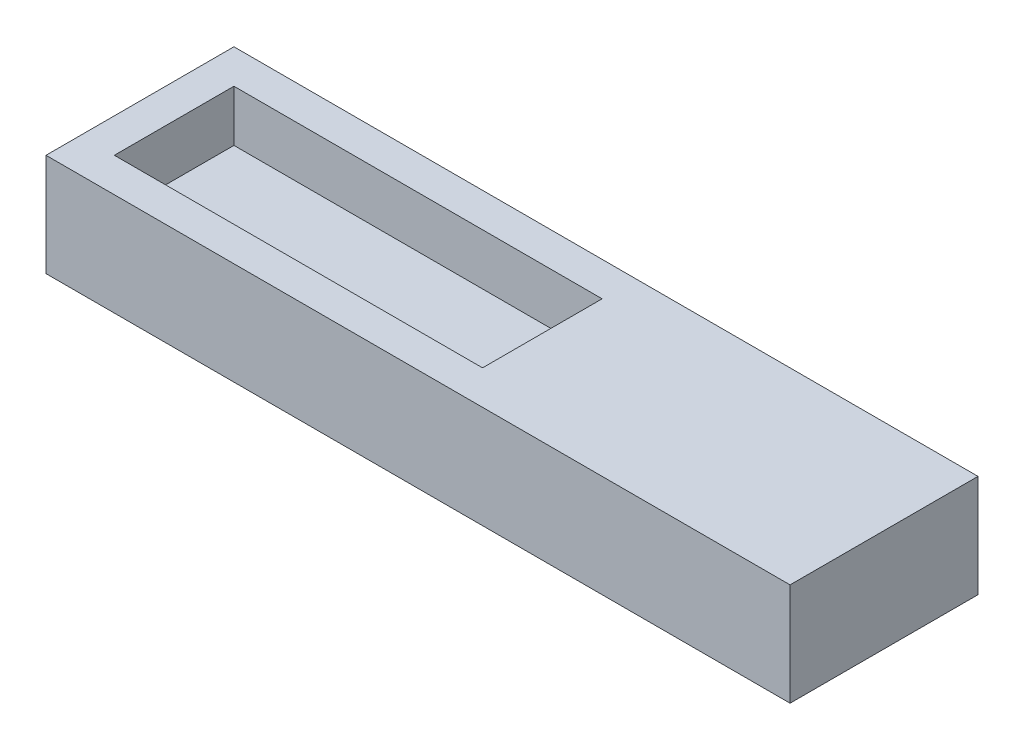
ISO-10303-21;
HEADER;
FILE_DESCRIPTION(('STEP AP214'),'2;1');
FILE_NAME('part.step','',(''),(''),'','','');
FILE_SCHEMA(('AUTOMOTIVE_DESIGN { 1 0 10303 214 1 1 1 1 }'));
ENDSEC;
DATA;
#1=APPLICATION_CONTEXT('core data for automotive mechanical design processes');
#2=APPLICATION_PROTOCOL_DEFINITION('international standard','automotive_design',2000,#1);
#3=PRODUCT_CONTEXT('',#1,'mechanical');
#4=PRODUCT('Part','Part','',(#3));
#5=PRODUCT_RELATED_PRODUCT_CATEGORY('part','',(#4));
#6=PRODUCT_DEFINITION_FORMATION('','',#4);
#7=PRODUCT_DEFINITION_CONTEXT('part definition',#1,'design');
#8=PRODUCT_DEFINITION('design','',#6,#7);
#9=PRODUCT_DEFINITION_SHAPE('','',#8);
#10=(LENGTH_UNIT() NAMED_UNIT(*) SI_UNIT(.MILLI.,.METRE.));
#11=(NAMED_UNIT(*) PLANE_ANGLE_UNIT() SI_UNIT($,.RADIAN.));
#12=(NAMED_UNIT(*) SI_UNIT($,.STERADIAN.) SOLID_ANGLE_UNIT());
#13=UNCERTAINTY_MEASURE_WITH_UNIT(LENGTH_MEASURE(1.E-05),#10,'distance_accuracy_value','');
#14=(GEOMETRIC_REPRESENTATION_CONTEXT(3) GLOBAL_UNCERTAINTY_ASSIGNED_CONTEXT((#13)) GLOBAL_UNIT_ASSIGNED_CONTEXT((#10,
#11,#12)) REPRESENTATION_CONTEXT('',''));
#15=CARTESIAN_POINT('',(0.,0.,0.));
#16=DIRECTION('',(0.,0.,1.));
#17=DIRECTION('',(1.,0.,0.));
#18=AXIS2_PLACEMENT_3D('',#15,#16,#17);
#19=CARTESIAN_POINT('',(0.,3.,0.));
#20=DIRECTION('',(0.,1.,0.));
#21=DIRECTION('',(0.,0.,1.));
#22=AXIS2_PLACEMENT_3D('',#19,#20,#21);
#23=PLANE('',#22);
#24=DIRECTION('',(0.,0.,1.));
#25=VECTOR('',#24,1.);
#26=CARTESIAN_POINT('',(0.,3.,0.));
#27=LINE('',#26,#25);
#28=CARTESIAN_POINT('',(0.,3.,0.));
#29=VERTEX_POINT('',#28);
#30=CARTESIAN_POINT('',(0.,3.,11.));
#31=VERTEX_POINT('',#30);
#32=EDGE_CURVE('E155',#29,#31,#27,.T.);
#33=ORIENTED_EDGE('',*,*,#32,.T.);
#34=DIRECTION('',(1.,0.,0.));
#35=VECTOR('',#34,1.);
#36=CARTESIAN_POINT('',(0.,3.,11.));
#37=LINE('',#36,#35);
#38=CARTESIAN_POINT('',(43.55,3.,11.));
#39=VERTEX_POINT('',#38);
#40=EDGE_CURVE('E157',#31,#39,#37,.T.);
#41=ORIENTED_EDGE('',*,*,#40,.T.);
#42=DIRECTION('',(0.,0.,-1.));
#43=VECTOR('',#42,1.);
#44=CARTESIAN_POINT('',(43.55,3.,0.));
#45=LINE('',#44,#43);
#46=CARTESIAN_POINT('',(43.55,3.,0.));
#47=VERTEX_POINT('',#46);
#48=EDGE_CURVE('E159',#39,#47,#45,.T.);
#49=ORIENTED_EDGE('',*,*,#48,.T.);
#50=DIRECTION('',(-1.,0.,0.));
#51=VECTOR('',#50,1.);
#52=CARTESIAN_POINT('',(0.,3.,0.));
#53=LINE('',#52,#51);
#54=EDGE_CURVE('E59',#47,#29,#53,.T.);
#55=ORIENTED_EDGE('',*,*,#54,.T.);
#56=EDGE_LOOP('',(#33,#41,#49,#55));
#57=FACE_BOUND('',#56,.T.);
#58=DIRECTION('',(1.,0.,0.));
#59=VECTOR('',#58,1.);
#60=CARTESIAN_POINT('',(2.,3.,9.));
#61=LINE('',#60,#59);
#62=CARTESIAN_POINT('',(2.,3.,9.));
#63=VERTEX_POINT('',#62);
#64=CARTESIAN_POINT('',(23.55,3.,9.));
#65=VERTEX_POINT('',#64);
#66=EDGE_CURVE('E130',#63,#65,#61,.T.);
#67=ORIENTED_EDGE('',*,*,#66,.F.);
#68=DIRECTION('',(0.,0.,1.));
#69=VECTOR('',#68,1.);
#70=CARTESIAN_POINT('',(2.,3.,2.));
#71=LINE('',#70,#69);
#72=CARTESIAN_POINT('',(2.,3.,2.));
#73=VERTEX_POINT('',#72);
#74=EDGE_CURVE('E128',#73,#63,#71,.T.);
#75=ORIENTED_EDGE('',*,*,#74,.F.);
#76=DIRECTION('',(-1.,0.,0.));
#77=VECTOR('',#76,1.);
#78=CARTESIAN_POINT('',(2.,3.,2.));
#79=LINE('',#78,#77);
#80=CARTESIAN_POINT('',(23.55,3.,2.));
#81=VERTEX_POINT('',#80);
#82=EDGE_CURVE('E135',#81,#73,#79,.T.);
#83=ORIENTED_EDGE('',*,*,#82,.F.);
#84=DIRECTION('',(0.,0.,-1.));
#85=VECTOR('',#84,1.);
#86=CARTESIAN_POINT('',(23.55,3.,2.));
#87=LINE('',#86,#85);
#88=EDGE_CURVE('E133',#65,#81,#87,.T.);
#89=ORIENTED_EDGE('',*,*,#88,.F.);
#90=EDGE_LOOP('',(#67,#75,#83,#89));
#91=FACE_BOUND('',#90,.T.);
#92=ADVANCED_FACE('F36',(#57,#91),#23,.T.);
#93=CARTESIAN_POINT('',(0.,3.,0.));
#94=DIRECTION('',(1.,0.,0.));
#95=DIRECTION('',(0.,0.,-1.));
#96=AXIS2_PLACEMENT_3D('',#93,#94,#95);
#97=PLANE('',#96);
#98=DIRECTION('',(0.,-1.,0.));
#99=VECTOR('',#98,1.);
#100=CARTESIAN_POINT('',(0.,3.,0.));
#101=LINE('',#100,#99);
#102=CARTESIAN_POINT('',(0.,-3.,0.));
#103=VERTEX_POINT('',#102);
#104=EDGE_CURVE('E109',#29,#103,#101,.T.);
#105=ORIENTED_EDGE('',*,*,#104,.T.);
#106=DIRECTION('',(0.,0.,1.));
#107=VECTOR('',#106,1.);
#108=CARTESIAN_POINT('',(0.,-3.,0.));
#109=LINE('',#108,#107);
#110=CARTESIAN_POINT('',(0.,-3.,11.));
#111=VERTEX_POINT('',#110);
#112=EDGE_CURVE('E118',#103,#111,#109,.T.);
#113=ORIENTED_EDGE('',*,*,#112,.T.);
#114=DIRECTION('',(0.,-1.,0.));
#115=VECTOR('',#114,1.);
#116=CARTESIAN_POINT('',(0.,3.,11.));
#117=LINE('',#116,#115);
#118=EDGE_CURVE('E11',#31,#111,#117,.T.);
#119=ORIENTED_EDGE('',*,*,#118,.F.);
#120=ORIENTED_EDGE('',*,*,#32,.F.);
#121=EDGE_LOOP('',(#105,#113,#119,#120));
#122=FACE_BOUND('',#121,.T.);
#123=ADVANCED_FACE('F38',(#122),#97,.F.);
#124=CARTESIAN_POINT('',(0.,3.,11.));
#125=DIRECTION('',(0.,0.,-1.));
#126=DIRECTION('',(-1.,0.,0.));
#127=AXIS2_PLACEMENT_3D('',#124,#125,#126);
#128=PLANE('',#127);
#129=ORIENTED_EDGE('',*,*,#118,.T.);
#130=DIRECTION('',(1.,0.,0.));
#131=VECTOR('',#130,1.);
#132=CARTESIAN_POINT('',(0.,-3.,11.));
#133=LINE('',#132,#131);
#134=CARTESIAN_POINT('',(43.55,-3.,11.));
#135=VERTEX_POINT('',#134);
#136=EDGE_CURVE('E125',#111,#135,#133,.T.);
#137=ORIENTED_EDGE('',*,*,#136,.T.);
#138=DIRECTION('',(0.,-1.,0.));
#139=VECTOR('',#138,1.);
#140=CARTESIAN_POINT('',(43.55,3.,11.));
#141=LINE('',#140,#139);
#142=EDGE_CURVE('E44',#39,#135,#141,.T.);
#143=ORIENTED_EDGE('',*,*,#142,.F.);
#144=ORIENTED_EDGE('',*,*,#40,.F.);
#145=EDGE_LOOP('',(#129,#137,#143,#144));
#146=FACE_BOUND('',#145,.T.);
#147=ADVANCED_FACE('F167',(#146),#128,.F.);
#148=CARTESIAN_POINT('',(43.55,3.,0.));
#149=DIRECTION('',(-1.,0.,0.));
#150=DIRECTION('',(0.,0.,1.));
#151=AXIS2_PLACEMENT_3D('',#148,#149,#150);
#152=PLANE('',#151);
#153=ORIENTED_EDGE('',*,*,#142,.T.);
#154=DIRECTION('',(0.,0.,1.));
#155=VECTOR('',#154,1.);
#156=CARTESIAN_POINT('',(43.55,-3.,0.));
#157=LINE('',#156,#155);
#158=CARTESIAN_POINT('',(43.55,-3.,0.));
#159=VERTEX_POINT('',#158);
#160=EDGE_CURVE('E115',#159,#135,#157,.T.);
#161=ORIENTED_EDGE('',*,*,#160,.F.);
#162=DIRECTION('',(0.,-1.,0.));
#163=VECTOR('',#162,1.);
#164=CARTESIAN_POINT('',(43.55,3.,0.));
#165=LINE('',#164,#163);
#166=EDGE_CURVE('E101',#47,#159,#165,.T.);
#167=ORIENTED_EDGE('',*,*,#166,.F.);
#168=ORIENTED_EDGE('',*,*,#48,.F.);
#169=EDGE_LOOP('',(#153,#161,#167,#168));
#170=FACE_BOUND('',#169,.T.);
#171=ADVANCED_FACE('F120',(#170),#152,.F.);
#172=CARTESIAN_POINT('',(0.,3.,0.));
#173=DIRECTION('',(0.,0.,1.));
#174=DIRECTION('',(1.,0.,0.));
#175=AXIS2_PLACEMENT_3D('',#172,#173,#174);
#176=PLANE('',#175);
#177=ORIENTED_EDGE('',*,*,#166,.T.);
#178=DIRECTION('',(1.,0.,0.));
#179=VECTOR('',#178,1.);
#180=CARTESIAN_POINT('',(0.,-3.,0.));
#181=LINE('',#180,#179);
#182=EDGE_CURVE('E104',#103,#159,#181,.T.);
#183=ORIENTED_EDGE('',*,*,#182,.F.);
#184=ORIENTED_EDGE('',*,*,#104,.F.);
#185=ORIENTED_EDGE('',*,*,#54,.F.);
#186=EDGE_LOOP('',(#177,#183,#184,#185));
#187=FACE_BOUND('',#186,.T.);
#188=ADVANCED_FACE('F103',(#187),#176,.F.);
#189=CARTESIAN_POINT('',(2.,3.,2.));
#190=DIRECTION('',(1.,0.,0.));
#191=DIRECTION('',(0.,0.,-1.));
#192=AXIS2_PLACEMENT_3D('',#189,#190,#191);
#193=PLANE('',#192);
#194=DIRECTION('',(0.,0.,1.));
#195=VECTOR('',#194,1.);
#196=CARTESIAN_POINT('',(2.,0.,2.));
#197=LINE('',#196,#195);
#198=CARTESIAN_POINT('',(2.,0.,2.));
#199=VERTEX_POINT('',#198);
#200=CARTESIAN_POINT('',(2.,0.,9.));
#201=VERTEX_POINT('',#200);
#202=EDGE_CURVE('E127',#199,#201,#197,.T.);
#203=ORIENTED_EDGE('',*,*,#202,.F.);
#204=DIRECTION('',(0.,-1.,0.));
#205=VECTOR('',#204,1.);
#206=CARTESIAN_POINT('',(2.,3.,2.));
#207=LINE('',#206,#205);
#208=EDGE_CURVE('E137',#73,#199,#207,.T.);
#209=ORIENTED_EDGE('',*,*,#208,.F.);
#210=ORIENTED_EDGE('',*,*,#74,.T.);
#211=DIRECTION('',(0.,-1.,0.));
#212=VECTOR('',#211,1.);
#213=CARTESIAN_POINT('',(2.,3.,9.));
#214=LINE('',#213,#212);
#215=EDGE_CURVE('E152',#63,#201,#214,.T.);
#216=ORIENTED_EDGE('',*,*,#215,.T.);
#217=EDGE_LOOP('',(#203,#209,#210,#216));
#218=FACE_BOUND('',#217,.T.);
#219=ADVANCED_FACE('F180',(#218),#193,.T.);
#220=CARTESIAN_POINT('',(2.,3.,9.));
#221=DIRECTION('',(0.,0.,-1.));
#222=DIRECTION('',(-1.,0.,0.));
#223=AXIS2_PLACEMENT_3D('',#220,#221,#222);
#224=PLANE('',#223);
#225=DIRECTION('',(1.,0.,0.));
#226=VECTOR('',#225,1.);
#227=CARTESIAN_POINT('',(2.,0.,9.));
#228=LINE('',#227,#226);
#229=CARTESIAN_POINT('',(23.55,0.,9.));
#230=VERTEX_POINT('',#229);
#231=EDGE_CURVE('E140',#201,#230,#228,.T.);
#232=ORIENTED_EDGE('',*,*,#231,.F.);
#233=ORIENTED_EDGE('',*,*,#215,.F.);
#234=ORIENTED_EDGE('',*,*,#66,.T.);
#235=DIRECTION('',(0.,-1.,0.));
#236=VECTOR('',#235,1.);
#237=CARTESIAN_POINT('',(23.55,3.,9.));
#238=LINE('',#237,#236);
#239=EDGE_CURVE('E150',#65,#230,#238,.T.);
#240=ORIENTED_EDGE('',*,*,#239,.T.);
#241=EDGE_LOOP('',(#232,#233,#234,#240));
#242=FACE_BOUND('',#241,.T.);
#243=ADVANCED_FACE('F186',(#242),#224,.T.);
#244=CARTESIAN_POINT('',(23.55,3.,2.));
#245=DIRECTION('',(-1.,0.,0.));
#246=DIRECTION('',(0.,0.,1.));
#247=AXIS2_PLACEMENT_3D('',#244,#245,#246);
#248=PLANE('',#247);
#249=DIRECTION('',(0.,0.,-1.));
#250=VECTOR('',#249,1.);
#251=CARTESIAN_POINT('',(23.55,0.,2.));
#252=LINE('',#251,#250);
#253=CARTESIAN_POINT('',(23.55,0.,2.));
#254=VERTEX_POINT('',#253);
#255=EDGE_CURVE('E143',#230,#254,#252,.T.);
#256=ORIENTED_EDGE('',*,*,#255,.F.);
#257=ORIENTED_EDGE('',*,*,#239,.F.);
#258=ORIENTED_EDGE('',*,*,#88,.T.);
#259=DIRECTION('',(0.,-1.,0.));
#260=VECTOR('',#259,1.);
#261=CARTESIAN_POINT('',(23.55,3.,2.));
#262=LINE('',#261,#260);
#263=EDGE_CURVE('E51',#81,#254,#262,.T.);
#264=ORIENTED_EDGE('',*,*,#263,.T.);
#265=EDGE_LOOP('',(#256,#257,#258,#264));
#266=FACE_BOUND('',#265,.T.);
#267=ADVANCED_FACE('F191',(#266),#248,.T.);
#268=CARTESIAN_POINT('',(2.,3.,2.));
#269=DIRECTION('',(0.,0.,1.));
#270=DIRECTION('',(1.,0.,0.));
#271=AXIS2_PLACEMENT_3D('',#268,#269,#270);
#272=PLANE('',#271);
#273=DIRECTION('',(-1.,0.,0.));
#274=VECTOR('',#273,1.);
#275=CARTESIAN_POINT('',(2.,0.,2.));
#276=LINE('',#275,#274);
#277=EDGE_CURVE('E131',#254,#199,#276,.T.);
#278=ORIENTED_EDGE('',*,*,#277,.F.);
#279=ORIENTED_EDGE('',*,*,#263,.F.);
#280=ORIENTED_EDGE('',*,*,#82,.T.);
#281=ORIENTED_EDGE('',*,*,#208,.T.);
#282=EDGE_LOOP('',(#278,#279,#280,#281));
#283=FACE_BOUND('',#282,.T.);
#284=ADVANCED_FACE('F200',(#283),#272,.T.);
#285=CARTESIAN_POINT('',(0.,0.,0.));
#286=DIRECTION('',(0.,1.,0.));
#287=DIRECTION('',(0.,0.,1.));
#288=AXIS2_PLACEMENT_3D('',#285,#286,#287);
#289=PLANE('',#288);
#290=ORIENTED_EDGE('',*,*,#277,.T.);
#291=ORIENTED_EDGE('',*,*,#202,.T.);
#292=ORIENTED_EDGE('',*,*,#231,.T.);
#293=ORIENTED_EDGE('',*,*,#255,.T.);
#294=EDGE_LOOP('',(#290,#291,#292,#293));
#295=FACE_BOUND('',#294,.T.);
#296=ADVANCED_FACE('F198',(#295),#289,.T.);
#297=CARTESIAN_POINT('',(0.,-3.,0.));
#298=DIRECTION('',(0.,1.,0.));
#299=DIRECTION('',(0.,0.,1.));
#300=AXIS2_PLACEMENT_3D('',#297,#298,#299);
#301=PLANE('',#300);
#302=ORIENTED_EDGE('',*,*,#160,.T.);
#303=ORIENTED_EDGE('',*,*,#136,.F.);
#304=ORIENTED_EDGE('',*,*,#112,.F.);
#305=ORIENTED_EDGE('',*,*,#182,.T.);
#306=EDGE_LOOP('',(#302,#303,#304,#305));
#307=FACE_BOUND('',#306,.T.);
#308=ADVANCED_FACE('F113',(#307),#301,.F.);
#309=CLOSED_SHELL('',(#92,#123,#147,#171,#188,#219,#243,#267,#284,#296,#308));
#310=MANIFOLD_SOLID_BREP('B2',#309);
#311=ADVANCED_BREP_SHAPE_REPRESENTATION('',(#18,#310),#14);
#312=SHAPE_DEFINITION_REPRESENTATION(#9,#311);
ENDSEC;
END-ISO-10303-21;
